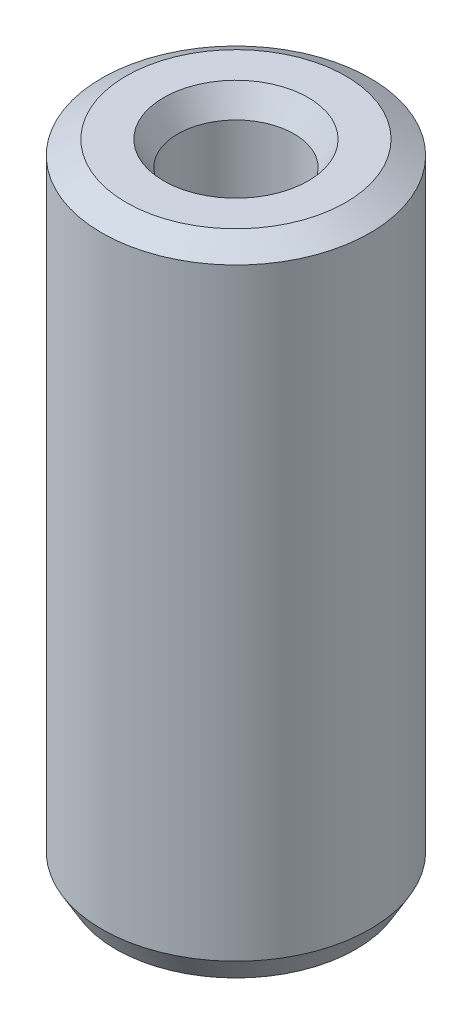
ISO-10303-21;
HEADER;
FILE_DESCRIPTION(('STEP AP214'),'2;1');
FILE_NAME('part.step','',(''),(''),'','','');
FILE_SCHEMA(('AUTOMOTIVE_DESIGN { 1 0 10303 214 1 1 1 1 }'));
ENDSEC;
DATA;
#1=APPLICATION_CONTEXT('core data for automotive mechanical design processes');
#2=APPLICATION_PROTOCOL_DEFINITION('international standard','automotive_design',2000,#1);
#3=PRODUCT_CONTEXT('',#1,'mechanical');
#4=PRODUCT('Part','Part','',(#3));
#5=PRODUCT_RELATED_PRODUCT_CATEGORY('part','',(#4));
#6=PRODUCT_DEFINITION_FORMATION('','',#4);
#7=PRODUCT_DEFINITION_CONTEXT('part definition',#1,'design');
#8=PRODUCT_DEFINITION('design','',#6,#7);
#9=PRODUCT_DEFINITION_SHAPE('','',#8);
#10=(LENGTH_UNIT() NAMED_UNIT(*) SI_UNIT(.MILLI.,.METRE.));
#11=(NAMED_UNIT(*) PLANE_ANGLE_UNIT() SI_UNIT($,.RADIAN.));
#12=(NAMED_UNIT(*) SI_UNIT($,.STERADIAN.) SOLID_ANGLE_UNIT());
#13=UNCERTAINTY_MEASURE_WITH_UNIT(LENGTH_MEASURE(1.E-05),#10,'distance_accuracy_value','');
#14=(GEOMETRIC_REPRESENTATION_CONTEXT(3) GLOBAL_UNCERTAINTY_ASSIGNED_CONTEXT((#13)) GLOBAL_UNIT_ASSIGNED_CONTEXT((#10,
#11,#12)) REPRESENTATION_CONTEXT('',''));
#15=CARTESIAN_POINT('',(0.,0.,0.));
#16=DIRECTION('',(0.,0.,1.));
#17=DIRECTION('',(1.,0.,0.));
#18=AXIS2_PLACEMENT_3D('',#15,#16,#17);
#19=CARTESIAN_POINT('',(0.,23.9130296924958,0.));
#20=DIRECTION('',(0.,-1.,0.));
#21=DIRECTION('',(0.,0.,-1.));
#22=AXIS2_PLACEMENT_3D('',#19,#20,#21);
#23=CYLINDRICAL_SURFACE('',#22,5.);
#24=CARTESIAN_POINT('',(0.,0.910752530745271,0.));
#25=DIRECTION('',(0.,1.,0.));
#26=DIRECTION('',(0.,0.,1.));
#27=AXIS2_PLACEMENT_3D('',#24,#25,#26);
#28=CIRCLE('',#27,5.);
#29=CARTESIAN_POINT('',(0.,0.910752530745271,5.));
#30=VERTEX_POINT('',#29);
#31=EDGE_CURVE('E10',#30,#30,#28,.T.);
#32=ORIENTED_EDGE('',*,*,#31,.T.);
#33=EDGE_LOOP('',(#32));
#34=FACE_BOUND('',#33,.T.);
#35=CARTESIAN_POINT('',(0.,23.3872064737049,0.));
#36=DIRECTION('',(0.,1.,0.));
#37=DIRECTION('',(0.,0.,1.));
#38=AXIS2_PLACEMENT_3D('',#35,#36,#37);
#39=CIRCLE('',#38,5.);
#40=CARTESIAN_POINT('',(0.,23.3872064737049,5.));
#41=VERTEX_POINT('',#40);
#42=EDGE_CURVE('E50',#41,#41,#39,.F.);
#43=ORIENTED_EDGE('',*,*,#42,.T.);
#44=EDGE_LOOP('',(#43));
#45=FACE_BOUND('',#44,.T.);
#46=ADVANCED_FACE('F39',(#34,#45),#23,.T.);
#47=CARTESIAN_POINT('',(0.,23.9130296924958,0.));
#48=DIRECTION('',(0.,1.,0.));
#49=DIRECTION('',(0.,0.,1.));
#50=AXIS2_PLACEMENT_3D('',#47,#48,#49);
#51=PLANE('',#50);
#52=CARTESIAN_POINT('',(0.,23.9130296924958,0.));
#53=DIRECTION('',(0.,1.,0.));
#54=DIRECTION('',(0.,0.,1.));
#55=AXIS2_PLACEMENT_3D('',#52,#53,#54);
#56=CIRCLE('',#55,2.69364240717589);
#57=CARTESIAN_POINT('',(0.,23.9130296924958,2.69364240717589));
#58=VERTEX_POINT('',#57);
#59=EDGE_CURVE('E58',#58,#58,#56,.F.);
#60=ORIENTED_EDGE('',*,*,#59,.T.);
#61=EDGE_LOOP('',(#60));
#62=FACE_BOUND('',#61,.T.);
#63=CARTESIAN_POINT('',(0.,23.9130296924958,0.));
#64=DIRECTION('',(0.,1.,0.));
#65=DIRECTION('',(0.,0.,1.));
#66=AXIS2_PLACEMENT_3D('',#63,#64,#65);
#67=CIRCLE('',#66,4.08924746925472);
#68=CARTESIAN_POINT('',(0.,23.9130296924958,4.08924746925472));
#69=VERTEX_POINT('',#68);
#70=EDGE_CURVE('E61',#69,#69,#67,.T.);
#71=ORIENTED_EDGE('',*,*,#70,.T.);
#72=EDGE_LOOP('',(#71));
#73=FACE_BOUND('',#72,.T.);
#74=ADVANCED_FACE('F88',(#62,#73),#51,.T.);
#75=CARTESIAN_POINT('',(0.,0.,0.));
#76=DIRECTION('',(0.,1.,0.));
#77=DIRECTION('',(0.,0.,1.));
#78=AXIS2_PLACEMENT_3D('',#75,#76,#77);
#79=PLANE('',#78);
#80=CARTESIAN_POINT('',(0.,0.,0.));
#81=DIRECTION('',(0.,1.,0.));
#82=DIRECTION('',(0.,0.,1.));
#83=AXIS2_PLACEMENT_3D('',#80,#81,#82);
#84=CIRCLE('',#83,3.07857171913026);
#85=CARTESIAN_POINT('',(0.,0.,3.07857171913026));
#86=VERTEX_POINT('',#85);
#87=EDGE_CURVE('E51',#86,#86,#84,.T.);
#88=ORIENTED_EDGE('',*,*,#87,.T.);
#89=EDGE_LOOP('',(#88));
#90=FACE_BOUND('',#89,.T.);
#91=CARTESIAN_POINT('',(0.,0.,0.));
#92=DIRECTION('',(0.,1.,0.));
#93=DIRECTION('',(0.,0.,1.));
#94=AXIS2_PLACEMENT_3D('',#91,#92,#93);
#95=CIRCLE('',#94,4.47417678120908);
#96=CARTESIAN_POINT('',(0.,0.,4.47417678120908));
#97=VERTEX_POINT('',#96);
#98=EDGE_CURVE('E54',#97,#97,#95,.F.);
#99=ORIENTED_EDGE('',*,*,#98,.T.);
#100=EDGE_LOOP('',(#99));
#101=FACE_BOUND('',#100,.T.);
#102=ADVANCED_FACE('F83',(#90,#101),#79,.F.);
#103=CARTESIAN_POINT('',(0.,23.9130296924958,0.));
#104=DIRECTION('',(0.,-1.,0.));
#105=DIRECTION('',(0.,0.,-1.));
#106=AXIS2_PLACEMENT_3D('',#103,#104,#105);
#107=CYLINDRICAL_SURFACE('',#106,2.16781918838497);
#108=CARTESIAN_POINT('',(0.,23.0022771617505,0.));
#109=DIRECTION('',(0.,1.,0.));
#110=DIRECTION('',(0.,0.,1.));
#111=AXIS2_PLACEMENT_3D('',#108,#109,#110);
#112=CIRCLE('',#111,2.16781918838497);
#113=CARTESIAN_POINT('',(0.,23.0022771617505,2.16781918838497));
#114=VERTEX_POINT('',#113);
#115=EDGE_CURVE('E67',#114,#114,#112,.T.);
#116=ORIENTED_EDGE('',*,*,#115,.T.);
#117=EDGE_LOOP('',(#116));
#118=FACE_BOUND('',#117,.T.);
#119=CARTESIAN_POINT('',(0.,0.525823218790928,0.));
#120=DIRECTION('',(0.,1.,0.));
#121=DIRECTION('',(0.,0.,1.));
#122=AXIS2_PLACEMENT_3D('',#119,#120,#121);
#123=CIRCLE('',#122,2.16781918838497);
#124=CARTESIAN_POINT('',(0.,0.525823218790928,2.16781918838497));
#125=VERTEX_POINT('',#124);
#126=EDGE_CURVE('E69',#125,#125,#123,.F.);
#127=ORIENTED_EDGE('',*,*,#126,.T.);
#128=EDGE_LOOP('',(#127));
#129=FACE_BOUND('',#128,.T.);
#130=ADVANCED_FACE('F71',(#118,#129),#107,.F.);
#131=CARTESIAN_POINT('',(0.,23.0022771617505,0.));
#132=DIRECTION('',(0.,1.,0.));
#133=DIRECTION('',(0.,0.,1.));
#134=AXIS2_PLACEMENT_3D('',#131,#132,#133);
#135=CONICAL_SURFACE('',#134,2.16781918838497,0.523598775598307);
#136=ORIENTED_EDGE('',*,*,#59,.F.);
#137=EDGE_LOOP('',(#136));
#138=FACE_BOUND('',#137,.T.);
#139=ORIENTED_EDGE('',*,*,#115,.F.);
#140=EDGE_LOOP('',(#139));
#141=FACE_BOUND('',#140,.T.);
#142=ADVANCED_FACE('F77',(#138,#141),#135,.F.);
#143=CARTESIAN_POINT('',(0.,0.,0.));
#144=DIRECTION('',(0.,-1.,0.));
#145=DIRECTION('',(0.,0.,-1.));
#146=AXIS2_PLACEMENT_3D('',#143,#144,#145);
#147=CONICAL_SURFACE('',#146,3.07857171913026,1.0471975511966);
#148=ORIENTED_EDGE('',*,*,#126,.F.);
#149=EDGE_LOOP('',(#148));
#150=FACE_BOUND('',#149,.T.);
#151=ORIENTED_EDGE('',*,*,#87,.F.);
#152=EDGE_LOOP('',(#151));
#153=FACE_BOUND('',#152,.T.);
#154=ADVANCED_FACE('F73',(#150,#153),#147,.F.);
#155=CARTESIAN_POINT('',(0.,0.910752530745271,0.));
#156=DIRECTION('',(0.,1.,0.));
#157=DIRECTION('',(0.,0.,1.));
#158=AXIS2_PLACEMENT_3D('',#155,#156,#157);
#159=CONICAL_SURFACE('',#158,5.,0.523598775598304);
#160=ORIENTED_EDGE('',*,*,#98,.F.);
#161=EDGE_LOOP('',(#160));
#162=FACE_BOUND('',#161,.T.);
#163=ORIENTED_EDGE('',*,*,#31,.F.);
#164=EDGE_LOOP('',(#163));
#165=FACE_BOUND('',#164,.T.);
#166=ADVANCED_FACE('F76',(#162,#165),#159,.T.);
#167=CARTESIAN_POINT('',(0.,23.9130296924958,0.));
#168=DIRECTION('',(0.,-1.,0.));
#169=DIRECTION('',(0.,0.,-1.));
#170=AXIS2_PLACEMENT_3D('',#167,#168,#169);
#171=CONICAL_SURFACE('',#170,4.08924746925472,1.04719755119659);
#172=ORIENTED_EDGE('',*,*,#42,.F.);
#173=EDGE_LOOP('',(#172));
#174=FACE_BOUND('',#173,.T.);
#175=ORIENTED_EDGE('',*,*,#70,.F.);
#176=EDGE_LOOP('',(#175));
#177=FACE_BOUND('',#176,.T.);
#178=ADVANCED_FACE('F45',(#174,#177),#171,.T.);
#179=CLOSED_SHELL('',(#46,#74,#102,#130,#142,#154,#166,#178));
#180=MANIFOLD_SOLID_BREP('B2',#179);
#181=ADVANCED_BREP_SHAPE_REPRESENTATION('',(#18,#180),#14);
#182=SHAPE_DEFINITION_REPRESENTATION(#9,#181);
ENDSEC;
END-ISO-10303-21;
